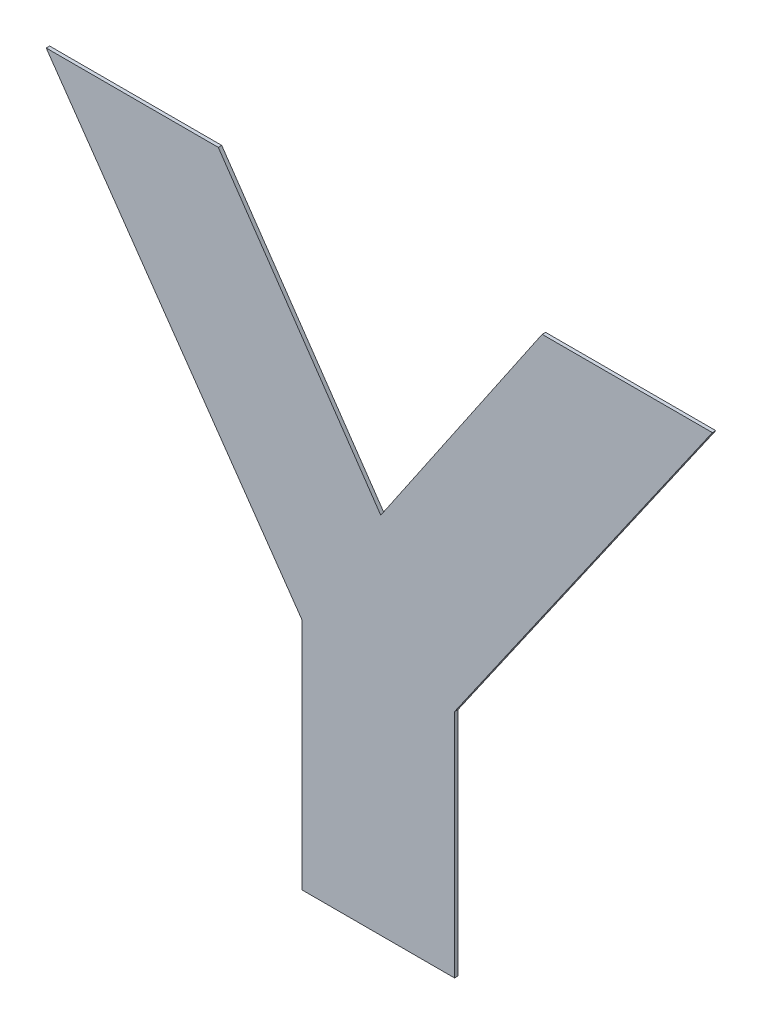
ISO-10303-21;
HEADER;
FILE_DESCRIPTION(('STEP AP214'),'2;1');
FILE_NAME('part.step','',(''),(''),'','','');
FILE_SCHEMA(('AUTOMOTIVE_DESIGN { 1 0 10303 214 1 1 1 1 }'));
ENDSEC;
DATA;
#1=APPLICATION_CONTEXT('core data for automotive mechanical design processes');
#2=APPLICATION_PROTOCOL_DEFINITION('international standard','automotive_design',2000,#1);
#3=PRODUCT_CONTEXT('',#1,'mechanical');
#4=PRODUCT('Part','Part','',(#3));
#5=PRODUCT_RELATED_PRODUCT_CATEGORY('part','',(#4));
#6=PRODUCT_DEFINITION_FORMATION('','',#4);
#7=PRODUCT_DEFINITION_CONTEXT('part definition',#1,'design');
#8=PRODUCT_DEFINITION('design','',#6,#7);
#9=PRODUCT_DEFINITION_SHAPE('','',#8);
#10=(LENGTH_UNIT() NAMED_UNIT(*) SI_UNIT(.MILLI.,.METRE.));
#11=(NAMED_UNIT(*) PLANE_ANGLE_UNIT() SI_UNIT($,.RADIAN.));
#12=(NAMED_UNIT(*) SI_UNIT($,.STERADIAN.) SOLID_ANGLE_UNIT());
#13=UNCERTAINTY_MEASURE_WITH_UNIT(LENGTH_MEASURE(1.E-05),#10,'distance_accuracy_value','');
#14=(GEOMETRIC_REPRESENTATION_CONTEXT(3) GLOBAL_UNCERTAINTY_ASSIGNED_CONTEXT((#13)) GLOBAL_UNIT_ASSIGNED_CONTEXT((#10,
#11,#12)) REPRESENTATION_CONTEXT('',''));
#15=CARTESIAN_POINT('',(0.,0.,0.));
#16=DIRECTION('',(0.,0.,1.));
#17=DIRECTION('',(1.,0.,0.));
#18=AXIS2_PLACEMENT_3D('',#15,#16,#17);
#19=CARTESIAN_POINT('',(0.251313182226,0.69313306153705,0.0009));
#20=DIRECTION('',(-0.820629637441726,-0.571460408210631,0.));
#21=DIRECTION('',(0.,0.,1.));
#22=AXIS2_PLACEMENT_3D('',#19,#20,#21);
#23=PLANE('',#22);
#24=DIRECTION('',(0.,0.,1.));
#25=VECTOR('',#24,1.);
#26=CARTESIAN_POINT('',(0.284815407576,0.645023133626999,0.));
#27=LINE('',#26,#25);
#28=CARTESIAN_POINT('',(0.284815407576,0.645023133626999,0.));
#29=VERTEX_POINT('',#28);
#30=CARTESIAN_POINT('',(0.284815407576,0.645023133626999,0.0009));
#31=VERTEX_POINT('',#30);
#32=EDGE_CURVE('E11',#29,#31,#27,.T.);
#33=ORIENTED_EDGE('',*,*,#32,.T.);
#34=DIRECTION('',(-0.571460408210631,0.820629637441726,0.));
#35=VECTOR('',#34,1.);
#36=CARTESIAN_POINT('',(0.284815407576,0.645023133626999,0.0009));
#37=LINE('',#36,#35);
#38=CARTESIAN_POINT('',(0.217810956876,0.7412429894471,0.0009));
#39=VERTEX_POINT('',#38);
#40=EDGE_CURVE('E157',#31,#39,#37,.T.);
#41=ORIENTED_EDGE('',*,*,#40,.T.);
#42=DIRECTION('',(0.,0.,1.));
#43=VECTOR('',#42,1.);
#44=CARTESIAN_POINT('',(0.217810956876,0.7412429894471,0.));
#45=LINE('',#44,#43);
#46=CARTESIAN_POINT('',(0.217810956876,0.7412429894471,0.));
#47=VERTEX_POINT('',#46);
#48=EDGE_CURVE('E24',#47,#39,#45,.T.);
#49=ORIENTED_EDGE('',*,*,#48,.F.);
#50=DIRECTION('',(-0.571460408210631,0.820629637441726,0.));
#51=VECTOR('',#50,1.);
#52=CARTESIAN_POINT('',(0.284815407576,0.645023133626999,0.));
#53=LINE('',#52,#51);
#54=EDGE_CURVE('E146',#29,#47,#53,.T.);
#55=ORIENTED_EDGE('',*,*,#54,.F.);
#56=EDGE_LOOP('',(#33,#41,#49,#55));
#57=FACE_BOUND('',#56,.T.);
#58=ADVANCED_FACE('F17',(#57),#23,.T.);
#59=CARTESIAN_POINT('',(0.240362480226,0.7412429894471,0.0009));
#60=DIRECTION('',(0.,1.,0.));
#61=DIRECTION('',(0.,0.,1.));
#62=AXIS2_PLACEMENT_3D('',#59,#60,#61);
#63=PLANE('',#62);
#64=ORIENTED_EDGE('',*,*,#48,.T.);
#65=DIRECTION('',(1.,0.,0.));
#66=VECTOR('',#65,1.);
#67=CARTESIAN_POINT('',(0.217810956876,0.7412429894471,0.0009));
#68=LINE('',#67,#66);
#69=CARTESIAN_POINT('',(0.262914003576,0.7412429894471,0.0009));
#70=VERTEX_POINT('',#69);
#71=EDGE_CURVE('E153',#39,#70,#68,.T.);
#72=ORIENTED_EDGE('',*,*,#71,.T.);
#73=DIRECTION('',(0.,0.,1.));
#74=VECTOR('',#73,1.);
#75=CARTESIAN_POINT('',(0.262914003576,0.7412429894471,0.));
#76=LINE('',#75,#74);
#77=CARTESIAN_POINT('',(0.262914003576,0.7412429894471,0.));
#78=VERTEX_POINT('',#77);
#79=EDGE_CURVE('E155',#78,#70,#76,.T.);
#80=ORIENTED_EDGE('',*,*,#79,.F.);
#81=DIRECTION('',(1.,0.,0.));
#82=VECTOR('',#81,1.);
#83=CARTESIAN_POINT('',(0.217810956876,0.7412429894471,0.));
#84=LINE('',#83,#82);
#85=EDGE_CURVE('E138',#47,#78,#84,.T.);
#86=ORIENTED_EDGE('',*,*,#85,.F.);
#87=EDGE_LOOP('',(#64,#72,#80,#86));
#88=FACE_BOUND('',#87,.T.);
#89=ADVANCED_FACE('F164',(#88),#63,.T.);
#90=CARTESIAN_POINT('',(0.28420589647605,0.71013813357205,0.0009));
#91=DIRECTION('',(0.8251882666148,0.564857791520363,0.));
#92=DIRECTION('',(0.,0.,-1.));
#93=AXIS2_PLACEMENT_3D('',#90,#91,#92);
#94=PLANE('',#93);
#95=ORIENTED_EDGE('',*,*,#79,.T.);
#96=DIRECTION('',(0.564857791520363,-0.8251882666148,0.));
#97=VECTOR('',#96,1.);
#98=CARTESIAN_POINT('',(0.262914003576,0.7412429894471,0.0009));
#99=LINE('',#98,#97);
#100=CARTESIAN_POINT('',(0.3054977893761,0.679033277696999,0.0009));
#101=VERTEX_POINT('',#100);
#102=EDGE_CURVE('E148',#70,#101,#99,.T.);
#103=ORIENTED_EDGE('',*,*,#102,.T.);
#104=DIRECTION('',(0.,0.,1.));
#105=VECTOR('',#104,1.);
#106=CARTESIAN_POINT('',(0.3054977893761,0.679033277696999,0.));
#107=LINE('',#106,#105);
#108=CARTESIAN_POINT('',(0.3054977893761,0.679033277696999,0.));
#109=VERTEX_POINT('',#108);
#110=EDGE_CURVE('E151',#109,#101,#107,.T.);
#111=ORIENTED_EDGE('',*,*,#110,.F.);
#112=DIRECTION('',(0.564857791520363,-0.8251882666148,0.));
#113=VECTOR('',#112,1.);
#114=CARTESIAN_POINT('',(0.262914003576,0.7412429894471,0.));
#115=LINE('',#114,#113);
#116=EDGE_CURVE('E130',#78,#109,#115,.T.);
#117=ORIENTED_EDGE('',*,*,#116,.F.);
#118=EDGE_LOOP('',(#95,#103,#111,#117));
#119=FACE_BOUND('',#118,.T.);
#120=ADVANCED_FACE('F167',(#119),#94,.T.);
#121=CARTESIAN_POINT('',(0.32664746767605,0.71013813357205,0.0009));
#122=DIRECTION('',(-0.826946573811709,0.562280503006352,0.));
#123=DIRECTION('',(0.,0.,1.));
#124=AXIS2_PLACEMENT_3D('',#121,#122,#123);
#125=PLANE('',#124);
#126=ORIENTED_EDGE('',*,*,#110,.T.);
#127=DIRECTION('',(0.562280503006351,0.826946573811709,0.));
#128=VECTOR('',#127,1.);
#129=CARTESIAN_POINT('',(0.3054977893761,0.679033277696999,0.0009));
#130=LINE('',#129,#128);
#131=CARTESIAN_POINT('',(0.347797145976,0.7412429894471,0.0009));
#132=VERTEX_POINT('',#131);
#133=EDGE_CURVE('E141',#101,#132,#130,.T.);
#134=ORIENTED_EDGE('',*,*,#133,.T.);
#135=DIRECTION('',(0.,0.,1.));
#136=VECTOR('',#135,1.);
#137=CARTESIAN_POINT('',(0.347797145976,0.7412429894471,0.));
#138=LINE('',#137,#136);
#139=CARTESIAN_POINT('',(0.347797145976,0.7412429894471,0.));
#140=VERTEX_POINT('',#139);
#141=EDGE_CURVE('E144',#140,#132,#138,.T.);
#142=ORIENTED_EDGE('',*,*,#141,.F.);
#143=DIRECTION('',(0.562280503006351,0.826946573811709,0.));
#144=VECTOR('',#143,1.);
#145=CARTESIAN_POINT('',(0.3054977893761,0.679033277696999,0.));
#146=LINE('',#145,#144);
#147=EDGE_CURVE('E122',#109,#140,#146,.T.);
#148=ORIENTED_EDGE('',*,*,#147,.F.);
#149=EDGE_LOOP('',(#126,#134,#142,#148));
#150=FACE_BOUND('',#149,.T.);
#151=ADVANCED_FACE('F171',(#150),#125,.T.);
#152=CARTESIAN_POINT('',(0.37010487377595,0.7412429894471,0.0009));
#153=DIRECTION('',(0.,1.,0.));
#154=DIRECTION('',(0.,0.,1.));
#155=AXIS2_PLACEMENT_3D('',#152,#153,#154);
#156=PLANE('',#155);
#157=ORIENTED_EDGE('',*,*,#141,.T.);
#158=DIRECTION('',(1.,0.,0.));
#159=VECTOR('',#158,1.);
#160=CARTESIAN_POINT('',(0.347797145976,0.7412429894471,0.0009));
#161=LINE('',#160,#159);
#162=CARTESIAN_POINT('',(0.3924126015759,0.7412429894471,0.0009));
#163=VERTEX_POINT('',#162);
#164=EDGE_CURVE('E133',#132,#163,#161,.T.);
#165=ORIENTED_EDGE('',*,*,#164,.T.);
#166=DIRECTION('',(0.,0.,1.));
#167=VECTOR('',#166,1.);
#168=CARTESIAN_POINT('',(0.3924126015759,0.7412429894471,0.));
#169=LINE('',#168,#167);
#170=CARTESIAN_POINT('',(0.3924126015759,0.7412429894471,0.));
#171=VERTEX_POINT('',#170);
#172=EDGE_CURVE('E136',#171,#163,#169,.T.);
#173=ORIENTED_EDGE('',*,*,#172,.F.);
#174=DIRECTION('',(1.,0.,0.));
#175=VECTOR('',#174,1.);
#176=CARTESIAN_POINT('',(0.347797145976,0.7412429894471,0.));
#177=LINE('',#176,#175);
#178=EDGE_CURVE('E95',#140,#171,#177,.T.);
#179=ORIENTED_EDGE('',*,*,#178,.F.);
#180=EDGE_LOOP('',(#157,#165,#173,#179));
#181=FACE_BOUND('',#180,.T.);
#182=ADVANCED_FACE('F174',(#181),#156,.T.);
#183=CARTESIAN_POINT('',(0.3586259406759,0.692686094562049,0.0009));
#184=DIRECTION('',(0.820842183617819,-0.571155066154131,0.));
#185=DIRECTION('',(0.,0.,-1.));
#186=AXIS2_PLACEMENT_3D('',#183,#184,#185);
#187=PLANE('',#186);
#188=ORIENTED_EDGE('',*,*,#172,.T.);
#189=DIRECTION('',(-0.571155066154131,-0.820842183617819,0.));
#190=VECTOR('',#189,1.);
#191=CARTESIAN_POINT('',(0.3924126015759,0.7412429894471,0.0009));
#192=LINE('',#191,#190);
#193=CARTESIAN_POINT('',(0.3248392797759,0.644129199676997,0.0009));
#194=VERTEX_POINT('',#193);
#195=EDGE_CURVE('E125',#163,#194,#192,.T.);
#196=ORIENTED_EDGE('',*,*,#195,.T.);
#197=DIRECTION('',(0.,0.,1.));
#198=VECTOR('',#197,1.);
#199=CARTESIAN_POINT('',(0.3248392797759,0.644129199676997,0.));
#200=LINE('',#199,#198);
#201=CARTESIAN_POINT('',(0.3248392797759,0.644129199676997,0.));
#202=VERTEX_POINT('',#201);
#203=EDGE_CURVE('E128',#202,#194,#200,.T.);
#204=ORIENTED_EDGE('',*,*,#203,.F.);
#205=DIRECTION('',(-0.571155066154131,-0.820842183617819,0.));
#206=VECTOR('',#205,1.);
#207=CARTESIAN_POINT('',(0.3924126015759,0.7412429894471,0.));
#208=LINE('',#207,#206);
#209=EDGE_CURVE('E112',#171,#202,#208,.T.);
#210=ORIENTED_EDGE('',*,*,#209,.F.);
#211=EDGE_LOOP('',(#188,#196,#204,#210));
#212=FACE_BOUND('',#211,.T.);
#213=ADVANCED_FACE('F178',(#212),#187,.T.);
#214=CARTESIAN_POINT('',(0.3248392797759,0.613895930196949,0.0009));
#215=DIRECTION('',(1.,0.,0.));
#216=DIRECTION('',(0.,0.,-1.));
#217=AXIS2_PLACEMENT_3D('',#214,#215,#216);
#218=PLANE('',#217);
#219=ORIENTED_EDGE('',*,*,#203,.T.);
#220=DIRECTION('',(0.,-1.,0.));
#221=VECTOR('',#220,1.);
#222=CARTESIAN_POINT('',(0.3248392797759,0.644129199676997,0.0009));
#223=LINE('',#222,#221);
#224=CARTESIAN_POINT('',(0.3248392797759,0.5836626607169,0.0009));
#225=VERTEX_POINT('',#224);
#226=EDGE_CURVE('E117',#194,#225,#223,.T.);
#227=ORIENTED_EDGE('',*,*,#226,.T.);
#228=DIRECTION('',(0.,0.,1.));
#229=VECTOR('',#228,1.);
#230=CARTESIAN_POINT('',(0.3248392797759,0.5836626607169,0.));
#231=LINE('',#230,#229);
#232=CARTESIAN_POINT('',(0.3248392797759,0.5836626607169,0.));
#233=VERTEX_POINT('',#232);
#234=EDGE_CURVE('E120',#233,#225,#231,.T.);
#235=ORIENTED_EDGE('',*,*,#234,.F.);
#236=DIRECTION('',(0.,-1.,0.));
#237=VECTOR('',#236,1.);
#238=CARTESIAN_POINT('',(0.3248392797759,0.644129199676997,0.));
#239=LINE('',#238,#237);
#240=EDGE_CURVE('E106',#202,#233,#239,.T.);
#241=ORIENTED_EDGE('',*,*,#240,.F.);
#242=EDGE_LOOP('',(#219,#227,#235,#241));
#243=FACE_BOUND('',#242,.T.);
#244=ADVANCED_FACE('F181',(#243),#218,.T.);
#245=CARTESIAN_POINT('',(0.30482734367595,0.5836626607169,0.0009));
#246=DIRECTION('',(0.,-1.,0.));
#247=DIRECTION('',(0.,0.,-1.));
#248=AXIS2_PLACEMENT_3D('',#245,#246,#247);
#249=PLANE('',#248);
#250=ORIENTED_EDGE('',*,*,#234,.T.);
#251=DIRECTION('',(-1.,0.,0.));
#252=VECTOR('',#251,1.);
#253=CARTESIAN_POINT('',(0.3248392797759,0.5836626607169,0.0009));
#254=LINE('',#253,#252);
#255=CARTESIAN_POINT('',(0.284815407576,0.5836626607169,0.0009));
#256=VERTEX_POINT('',#255);
#257=EDGE_CURVE('E92',#225,#256,#254,.T.);
#258=ORIENTED_EDGE('',*,*,#257,.T.);
#259=DIRECTION('',(0.,0.,1.));
#260=VECTOR('',#259,1.);
#261=CARTESIAN_POINT('',(0.284815407576,0.5836626607169,0.));
#262=LINE('',#261,#260);
#263=CARTESIAN_POINT('',(0.284815407576,0.5836626607169,0.));
#264=VERTEX_POINT('',#263);
#265=EDGE_CURVE('E85',#264,#256,#262,.T.);
#266=ORIENTED_EDGE('',*,*,#265,.F.);
#267=DIRECTION('',(-1.,0.,0.));
#268=VECTOR('',#267,1.);
#269=CARTESIAN_POINT('',(0.3248392797759,0.5836626607169,0.));
#270=LINE('',#269,#268);
#271=EDGE_CURVE('E89',#233,#264,#270,.T.);
#272=ORIENTED_EDGE('',*,*,#271,.F.);
#273=EDGE_LOOP('',(#250,#258,#266,#272));
#274=FACE_BOUND('',#273,.T.);
#275=ADVANCED_FACE('F87',(#274),#249,.T.);
#276=CARTESIAN_POINT('',(0.284815407576,0.61434289717195,0.0009));
#277=DIRECTION('',(-1.,0.,0.));
#278=DIRECTION('',(0.,0.,1.));
#279=AXIS2_PLACEMENT_3D('',#276,#277,#278);
#280=PLANE('',#279);
#281=ORIENTED_EDGE('',*,*,#265,.T.);
#282=DIRECTION('',(0.,1.,0.));
#283=VECTOR('',#282,1.);
#284=CARTESIAN_POINT('',(0.284815407576,0.5836626607169,0.0009));
#285=LINE('',#284,#283);
#286=EDGE_CURVE('E108',#256,#31,#285,.T.);
#287=ORIENTED_EDGE('',*,*,#286,.T.);
#288=ORIENTED_EDGE('',*,*,#32,.F.);
#289=DIRECTION('',(0.,1.,0.));
#290=VECTOR('',#289,1.);
#291=CARTESIAN_POINT('',(0.284815407576,0.5836626607169,0.));
#292=LINE('',#291,#290);
#293=EDGE_CURVE('E98',#264,#29,#292,.T.);
#294=ORIENTED_EDGE('',*,*,#293,.F.);
#295=EDGE_LOOP('',(#281,#287,#288,#294));
#296=FACE_BOUND('',#295,.T.);
#297=ADVANCED_FACE('F99',(#296),#280,.T.);
#298=CARTESIAN_POINT('',(0.30511177922595,0.5836626607169,0.));
#299=DIRECTION('',(0.,0.,1.));
#300=DIRECTION('',(1.,0.,0.));
#301=AXIS2_PLACEMENT_3D('',#298,#299,#300);
#302=PLANE('',#301);
#303=ORIENTED_EDGE('',*,*,#54,.T.);
#304=ORIENTED_EDGE('',*,*,#85,.T.);
#305=ORIENTED_EDGE('',*,*,#116,.T.);
#306=ORIENTED_EDGE('',*,*,#147,.T.);
#307=ORIENTED_EDGE('',*,*,#178,.T.);
#308=ORIENTED_EDGE('',*,*,#209,.T.);
#309=ORIENTED_EDGE('',*,*,#240,.T.);
#310=ORIENTED_EDGE('',*,*,#271,.T.);
#311=ORIENTED_EDGE('',*,*,#293,.T.);
#312=EDGE_LOOP('',(#303,#304,#305,#306,#307,#308,#309,#310,#311));
#313=FACE_BOUND('',#312,.T.);
#314=ADVANCED_FACE('F103',(#313),#302,.F.);
#315=CARTESIAN_POINT('',(0.30511177922595,0.5836626607169,0.0009));
#316=DIRECTION('',(0.,0.,1.));
#317=DIRECTION('',(1.,0.,0.));
#318=AXIS2_PLACEMENT_3D('',#315,#316,#317);
#319=PLANE('',#318);
#320=ORIENTED_EDGE('',*,*,#40,.F.);
#321=ORIENTED_EDGE('',*,*,#286,.F.);
#322=ORIENTED_EDGE('',*,*,#257,.F.);
#323=ORIENTED_EDGE('',*,*,#226,.F.);
#324=ORIENTED_EDGE('',*,*,#195,.F.);
#325=ORIENTED_EDGE('',*,*,#164,.F.);
#326=ORIENTED_EDGE('',*,*,#133,.F.);
#327=ORIENTED_EDGE('',*,*,#102,.F.);
#328=ORIENTED_EDGE('',*,*,#71,.F.);
#329=EDGE_LOOP('',(#320,#321,#322,#323,#324,#325,#326,#327,#328));
#330=FACE_BOUND('',#329,.T.);
#331=ADVANCED_FACE('F162',(#330),#319,.T.);
#332=CLOSED_SHELL('',(#58,#89,#120,#151,#182,#213,#244,#275,#297,#314,#331));
#333=MANIFOLD_SOLID_BREP('B1',#332);
#334=ADVANCED_BREP_SHAPE_REPRESENTATION('',(#18,#333),#14);
#335=SHAPE_DEFINITION_REPRESENTATION(#9,#334);
ENDSEC;
END-ISO-10303-21;
